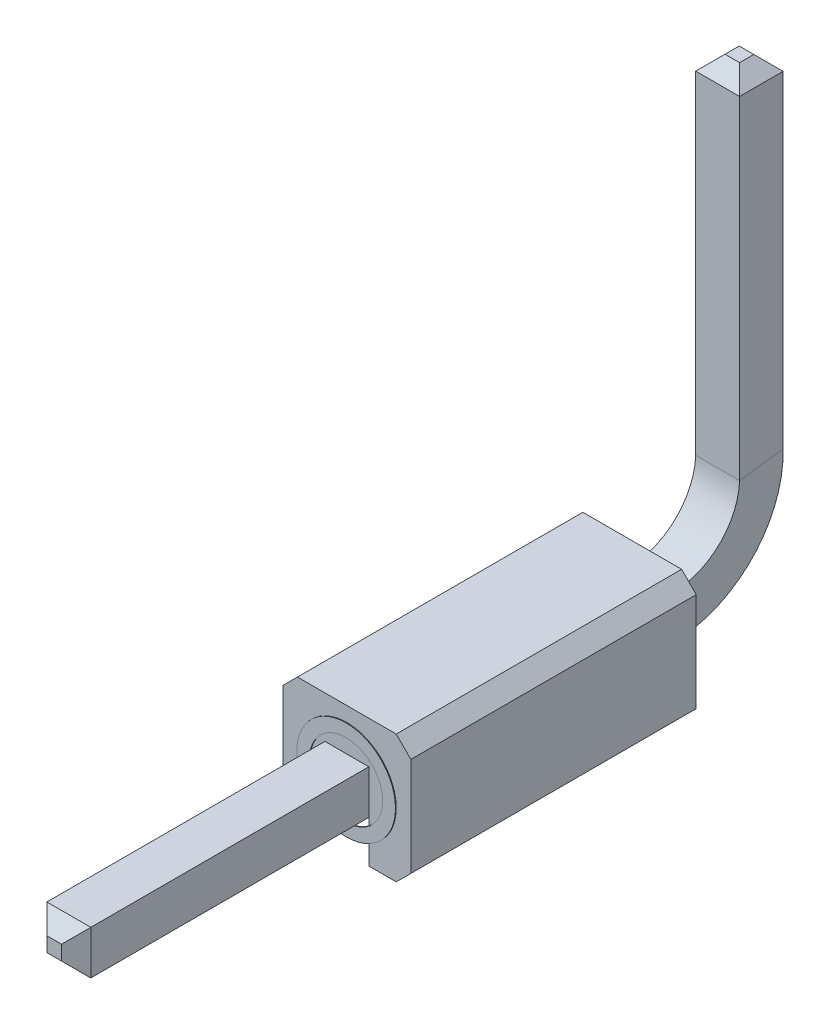
ISO-10303-21;
HEADER;
FILE_DESCRIPTION(('STEP AP214'),'2;1');
FILE_NAME('part.step','',(''),(''),'','','');
FILE_SCHEMA(('AUTOMOTIVE_DESIGN { 1 0 10303 214 1 1 1 1 }'));
ENDSEC;
DATA;
#1=APPLICATION_CONTEXT('core data for automotive mechanical design processes');
#2=APPLICATION_PROTOCOL_DEFINITION('international standard','automotive_design',2000,#1);
#3=PRODUCT_CONTEXT('',#1,'mechanical');
#4=PRODUCT('Part','Part','',(#3));
#5=PRODUCT_RELATED_PRODUCT_CATEGORY('part','',(#4));
#6=PRODUCT_DEFINITION_FORMATION('','',#4);
#7=PRODUCT_DEFINITION_CONTEXT('part definition',#1,'design');
#8=PRODUCT_DEFINITION('design','',#6,#7);
#9=PRODUCT_DEFINITION_SHAPE('','',#8);
#10=(LENGTH_UNIT() NAMED_UNIT(*) SI_UNIT(.MILLI.,.METRE.));
#11=(NAMED_UNIT(*) PLANE_ANGLE_UNIT() SI_UNIT($,.RADIAN.));
#12=(NAMED_UNIT(*) SI_UNIT($,.STERADIAN.) SOLID_ANGLE_UNIT());
#13=UNCERTAINTY_MEASURE_WITH_UNIT(LENGTH_MEASURE(1.E-05),#10,'distance_accuracy_value','');
#14=(GEOMETRIC_REPRESENTATION_CONTEXT(3) GLOBAL_UNCERTAINTY_ASSIGNED_CONTEXT((#13)) GLOBAL_UNIT_ASSIGNED_CONTEXT((#10,
#11,#12)) REPRESENTATION_CONTEXT('',''));
#15=CARTESIAN_POINT('',(0.,0.,0.));
#16=DIRECTION('',(0.,0.,1.));
#17=DIRECTION('',(1.,0.,0.));
#18=AXIS2_PLACEMENT_3D('',#15,#16,#17);
#19=CARTESIAN_POINT('',(-0.3,1.15200115929378,-2.26783114914556));
#20=DIRECTION('',(0.,0.,1.));
#21=DIRECTION('',(1.,0.,0.));
#22=AXIS2_PLACEMENT_3D('',#19,#20,#21);
#23=PLANE('',#22);
#24=DIRECTION('',(0.,1.,0.));
#25=VECTOR('',#24,1.);
#26=CARTESIAN_POINT('',(0.3,1.15200115929378,-2.26783114914556));
#27=LINE('',#26,#25);
#28=CARTESIAN_POINT('',(0.3,1.15200115929378,-2.26783114914556));
#29=VERTEX_POINT('',#28);
#30=CARTESIAN_POINT('',(0.3,5.7,-2.26783114914556));
#31=VERTEX_POINT('',#30);
#32=EDGE_CURVE('E604',#29,#31,#27,.T.);
#33=ORIENTED_EDGE('',*,*,#32,.T.);
#34=DIRECTION('',(-1.,0.,0.));
#35=VECTOR('',#34,1.);
#36=CARTESIAN_POINT('',(-0.3,5.7,-2.26783114914556));
#37=LINE('',#36,#35);
#38=CARTESIAN_POINT('',(-0.3,5.7,-2.26783114914556));
#39=VERTEX_POINT('',#38);
#40=EDGE_CURVE('E386',#31,#39,#37,.T.);
#41=ORIENTED_EDGE('',*,*,#40,.T.);
#42=DIRECTION('',(0.,1.,0.));
#43=VECTOR('',#42,1.);
#44=CARTESIAN_POINT('',(-0.3,1.15200115929378,-2.26783114914556));
#45=LINE('',#44,#43);
#46=CARTESIAN_POINT('',(-0.3,1.15200115929378,-2.26783114914556));
#47=VERTEX_POINT('',#46);
#48=EDGE_CURVE('E593',#47,#39,#45,.T.);
#49=ORIENTED_EDGE('',*,*,#48,.F.);
#50=DIRECTION('',(1.,0.,0.));
#51=VECTOR('',#50,1.);
#52=CARTESIAN_POINT('',(-0.3,1.15200115929378,-2.26783114914556));
#53=LINE('',#52,#51);
#54=EDGE_CURVE('E236',#47,#29,#53,.T.);
#55=ORIENTED_EDGE('',*,*,#54,.T.);
#56=EDGE_LOOP('',(#33,#41,#49,#55));
#57=FACE_BOUND('',#56,.T.);
#58=ADVANCED_FACE('F34',(#57),#23,.T.);
#59=CARTESIAN_POINT('',(0.3,1.15200115929378,-2.26783114914556));
#60=DIRECTION('',(1.,0.,0.));
#61=DIRECTION('',(0.,0.,-1.));
#62=AXIS2_PLACEMENT_3D('',#59,#60,#61);
#63=PLANE('',#62);
#64=DIRECTION('',(0.,1.,0.));
#65=VECTOR('',#64,1.);
#66=CARTESIAN_POINT('',(0.3,1.2326939716059,-2.86238028087578));
#67=LINE('',#66,#65);
#68=CARTESIAN_POINT('',(0.3,1.2326939716059,-2.86238028087578));
#69=VERTEX_POINT('',#68);
#70=CARTESIAN_POINT('',(0.3,5.7,-2.86238028087578));
#71=VERTEX_POINT('',#70);
#72=EDGE_CURVE('E588',#69,#71,#67,.T.);
#73=ORIENTED_EDGE('',*,*,#72,.T.);
#74=DIRECTION('',(0.,0.,1.));
#75=VECTOR('',#74,1.);
#76=CARTESIAN_POINT('',(0.3,5.7,-2.26783114914556));
#77=LINE('',#76,#75);
#78=EDGE_CURVE('E402',#71,#31,#77,.T.);
#79=ORIENTED_EDGE('',*,*,#78,.T.);
#80=ORIENTED_EDGE('',*,*,#32,.F.);
#81=DIRECTION('',(0.,0.134488020520202,-0.99091521955037));
#82=VECTOR('',#81,1.);
#83=CARTESIAN_POINT('',(0.3,1.15200115929378,-2.26783114914556));
#84=LINE('',#83,#82);
#85=EDGE_CURVE('E607',#29,#69,#84,.T.);
#86=ORIENTED_EDGE('',*,*,#85,.T.);
#87=EDGE_LOOP('',(#73,#79,#80,#86));
#88=FACE_BOUND('',#87,.T.);
#89=ADVANCED_FACE('F477',(#88),#63,.T.);
#90=CARTESIAN_POINT('',(0.3,1.2326939716059,-2.86238028087578));
#91=DIRECTION('',(0.,0.,-1.));
#92=DIRECTION('',(-1.,0.,0.));
#93=AXIS2_PLACEMENT_3D('',#90,#91,#92);
#94=PLANE('',#93);
#95=DIRECTION('',(0.,1.,0.));
#96=VECTOR('',#95,1.);
#97=CARTESIAN_POINT('',(-0.3,1.2326939716059,-2.86238028087578));
#98=LINE('',#97,#96);
#99=CARTESIAN_POINT('',(-0.3,1.2326939716059,-2.86238028087578));
#100=VERTEX_POINT('',#99);
#101=CARTESIAN_POINT('',(-0.3,5.7,-2.86238028087578));
#102=VERTEX_POINT('',#101);
#103=EDGE_CURVE('E583',#100,#102,#98,.T.);
#104=ORIENTED_EDGE('',*,*,#103,.T.);
#105=DIRECTION('',(1.,0.,0.));
#106=VECTOR('',#105,1.);
#107=CARTESIAN_POINT('',(0.3,5.7,-2.86238028087578));
#108=LINE('',#107,#106);
#109=EDGE_CURVE('E400',#102,#71,#108,.T.);
#110=ORIENTED_EDGE('',*,*,#109,.T.);
#111=ORIENTED_EDGE('',*,*,#72,.F.);
#112=DIRECTION('',(-1.,0.,0.));
#113=VECTOR('',#112,1.);
#114=CARTESIAN_POINT('',(0.3,1.2326939716059,-2.86238028087578));
#115=LINE('',#114,#113);
#116=EDGE_CURVE('E598',#69,#100,#115,.T.);
#117=ORIENTED_EDGE('',*,*,#116,.T.);
#118=EDGE_LOOP('',(#104,#110,#111,#117));
#119=FACE_BOUND('',#118,.T.);
#120=ADVANCED_FACE('F483',(#119),#94,.T.);
#121=CARTESIAN_POINT('',(-0.3,1.2326939716059,-2.86238028087578));
#122=DIRECTION('',(-1.,0.,0.));
#123=DIRECTION('',(0.,0.,1.));
#124=AXIS2_PLACEMENT_3D('',#121,#122,#123);
#125=PLANE('',#124);
#126=ORIENTED_EDGE('',*,*,#48,.T.);
#127=DIRECTION('',(0.,0.,-1.));
#128=VECTOR('',#127,1.);
#129=CARTESIAN_POINT('',(-0.3,5.7,-2.86238028087578));
#130=LINE('',#129,#128);
#131=EDGE_CURVE('E398',#39,#102,#130,.T.);
#132=ORIENTED_EDGE('',*,*,#131,.T.);
#133=ORIENTED_EDGE('',*,*,#103,.F.);
#134=DIRECTION('',(0.,-0.134488020520202,0.99091521955037));
#135=VECTOR('',#134,1.);
#136=CARTESIAN_POINT('',(-0.3,1.2326939716059,-2.86238028087578));
#137=LINE('',#136,#135);
#138=EDGE_CURVE('E591',#100,#47,#137,.T.);
#139=ORIENTED_EDGE('',*,*,#138,.T.);
#140=EDGE_LOOP('',(#126,#132,#133,#139));
#141=FACE_BOUND('',#140,.T.);
#142=ADVANCED_FACE('F498',(#141),#125,.T.);
#143=CARTESIAN_POINT('',(0.,0.,2.8));
#144=DIRECTION('',(0.,0.,-1.));
#145=DIRECTION('',(-1.,0.,0.));
#146=AXIS2_PLACEMENT_3D('',#143,#144,#145);
#147=PLANE('',#146);
#148=DIRECTION('',(0.,1.,0.));
#149=VECTOR('',#148,1.);
#150=CARTESIAN_POINT('',(0.3,0.3,2.8));
#151=LINE('',#150,#149);
#152=CARTESIAN_POINT('',(0.3,-0.4,2.8));
#153=VERTEX_POINT('',#152);
#154=CARTESIAN_POINT('',(0.3,-0.3,2.8));
#155=VERTEX_POINT('',#154);
#156=EDGE_CURVE('E300',#153,#155,#151,.T.);
#157=ORIENTED_EDGE('',*,*,#156,.F.);
#158=CARTESIAN_POINT('',(0.,0.,2.8));
#159=DIRECTION('',(0.,0.,-1.));
#160=DIRECTION('',(-1.,0.,0.));
#161=AXIS2_PLACEMENT_3D('',#158,#159,#160);
#162=CIRCLE('',#161,0.5);
#163=CARTESIAN_POINT('',(-0.3,-0.4,2.8));
#164=VERTEX_POINT('',#163);
#165=EDGE_CURVE('E367',#153,#164,#162,.F.);
#166=ORIENTED_EDGE('',*,*,#165,.T.);
#167=DIRECTION('',(0.,-1.,0.));
#168=VECTOR('',#167,1.);
#169=CARTESIAN_POINT('',(-0.3,0.3,2.8));
#170=LINE('',#169,#168);
#171=CARTESIAN_POINT('',(-0.3,-0.3,2.8));
#172=VERTEX_POINT('',#171);
#173=EDGE_CURVE('E306',#172,#164,#170,.T.);
#174=ORIENTED_EDGE('',*,*,#173,.F.);
#175=CARTESIAN_POINT('',(-0.3,0.3,2.8));
#176=VERTEX_POINT('',#175);
#177=EDGE_CURVE('E303',#176,#172,#170,.T.);
#178=ORIENTED_EDGE('',*,*,#177,.F.);
#179=DIRECTION('',(-1.,0.,0.));
#180=VECTOR('',#179,1.);
#181=CARTESIAN_POINT('',(-0.3,0.3,2.8));
#182=LINE('',#181,#180);
#183=CARTESIAN_POINT('',(0.3,0.3,2.8));
#184=VERTEX_POINT('',#183);
#185=EDGE_CURVE('E298',#184,#176,#182,.T.);
#186=ORIENTED_EDGE('',*,*,#185,.F.);
#187=EDGE_CURVE('E292',#155,#184,#151,.T.);
#188=ORIENTED_EDGE('',*,*,#187,.F.);
#189=EDGE_LOOP('',(#157,#166,#174,#178,#186,#188));
#190=FACE_BOUND('',#189,.T.);
#191=ADVANCED_FACE('F502',(#190),#147,.F.);
#192=CARTESIAN_POINT('',(0.675,0.875,-1.1));
#193=DIRECTION('',(0.,1.,0.));
#194=DIRECTION('',(-1.,0.,0.));
#195=AXIS2_PLACEMENT_3D('',#192,#193,#194);
#196=PLANE('',#195);
#197=DIRECTION('',(0.,0.,1.));
#198=VECTOR('',#197,1.);
#199=CARTESIAN_POINT('',(-0.675,0.875,-1.1));
#200=LINE('',#199,#198);
#201=CARTESIAN_POINT('',(-0.675,0.875,-1.1));
#202=VERTEX_POINT('',#201);
#203=CARTESIAN_POINT('',(-0.675,0.875,2.8));
#204=VERTEX_POINT('',#203);
#205=EDGE_CURVE('E364',#202,#204,#200,.T.);
#206=ORIENTED_EDGE('',*,*,#205,.T.);
#207=DIRECTION('',(-1.,0.,0.));
#208=VECTOR('',#207,1.);
#209=CARTESIAN_POINT('',(0.675,0.875,2.8));
#210=LINE('',#209,#208);
#211=CARTESIAN_POINT('',(0.675,0.875,2.8));
#212=VERTEX_POINT('',#211);
#213=EDGE_CURVE('E305',#212,#204,#210,.T.);
#214=ORIENTED_EDGE('',*,*,#213,.F.);
#215=DIRECTION('',(0.,0.,1.));
#216=VECTOR('',#215,1.);
#217=CARTESIAN_POINT('',(0.675,0.875,-1.1));
#218=LINE('',#217,#216);
#219=CARTESIAN_POINT('',(0.675,0.875,-1.1));
#220=VERTEX_POINT('',#219);
#221=EDGE_CURVE('E365',#220,#212,#218,.T.);
#222=ORIENTED_EDGE('',*,*,#221,.F.);
#223=DIRECTION('',(-1.,0.,0.));
#224=VECTOR('',#223,1.);
#225=CARTESIAN_POINT('',(0.675,0.875,-1.1));
#226=LINE('',#225,#224);
#227=EDGE_CURVE('E340',#220,#202,#226,.T.);
#228=ORIENTED_EDGE('',*,*,#227,.T.);
#229=EDGE_LOOP('',(#206,#214,#222,#228));
#230=FACE_BOUND('',#229,.T.);
#231=ADVANCED_FACE('F549',(#230),#196,.T.);
#232=CARTESIAN_POINT('',(0.875,0.675,-1.1));
#233=DIRECTION('',(0.707106781186548,0.707106781186548,0.));
#234=DIRECTION('',(-0.707106781186548,0.707106781186548,0.));
#235=AXIS2_PLACEMENT_3D('',#232,#233,#234);
#236=PLANE('',#235);
#237=ORIENTED_EDGE('',*,*,#221,.T.);
#238=DIRECTION('',(-0.707106781186547,0.707106781186547,0.));
#239=VECTOR('',#238,1.);
#240=CARTESIAN_POINT('',(0.875,0.675,2.8));
#241=LINE('',#240,#239);
#242=CARTESIAN_POINT('',(0.875,0.675,2.8));
#243=VERTEX_POINT('',#242);
#244=EDGE_CURVE('E328',#243,#212,#241,.T.);
#245=ORIENTED_EDGE('',*,*,#244,.F.);
#246=DIRECTION('',(0.,0.,1.));
#247=VECTOR('',#246,1.);
#248=CARTESIAN_POINT('',(0.875,0.675,-1.1));
#249=LINE('',#248,#247);
#250=CARTESIAN_POINT('',(0.875,0.675,-1.1));
#251=VERTEX_POINT('',#250);
#252=EDGE_CURVE('E368',#251,#243,#249,.T.);
#253=ORIENTED_EDGE('',*,*,#252,.F.);
#254=DIRECTION('',(-0.707106781186547,0.707106781186547,0.));
#255=VECTOR('',#254,1.);
#256=CARTESIAN_POINT('',(0.875,0.675,-1.1));
#257=LINE('',#256,#255);
#258=EDGE_CURVE('E361',#251,#220,#257,.T.);
#259=ORIENTED_EDGE('',*,*,#258,.T.);
#260=EDGE_LOOP('',(#237,#245,#253,#259));
#261=FACE_BOUND('',#260,.T.);
#262=ADVANCED_FACE('F546',(#261),#236,.T.);
#263=CARTESIAN_POINT('',(0.875,-0.675,-1.1));
#264=DIRECTION('',(1.,0.,0.));
#265=DIRECTION('',(0.,0.,-1.));
#266=AXIS2_PLACEMENT_3D('',#263,#264,#265);
#267=PLANE('',#266);
#268=ORIENTED_EDGE('',*,*,#252,.T.);
#269=DIRECTION('',(0.,1.,0.));
#270=VECTOR('',#269,1.);
#271=CARTESIAN_POINT('',(0.875,-0.675,2.8));
#272=LINE('',#271,#270);
#273=CARTESIAN_POINT('',(0.875,-0.675,2.8));
#274=VERTEX_POINT('',#273);
#275=EDGE_CURVE('E325',#274,#243,#272,.T.);
#276=ORIENTED_EDGE('',*,*,#275,.F.);
#277=DIRECTION('',(0.,0.,1.));
#278=VECTOR('',#277,1.);
#279=CARTESIAN_POINT('',(0.875,-0.675,-1.1));
#280=LINE('',#279,#278);
#281=CARTESIAN_POINT('',(0.875,-0.675,-1.1));
#282=VERTEX_POINT('',#281);
#283=EDGE_CURVE('E370',#282,#274,#280,.T.);
#284=ORIENTED_EDGE('',*,*,#283,.F.);
#285=DIRECTION('',(0.,1.,0.));
#286=VECTOR('',#285,1.);
#287=CARTESIAN_POINT('',(0.875,-0.675,-1.1));
#288=LINE('',#287,#286);
#289=EDGE_CURVE('E358',#282,#251,#288,.T.);
#290=ORIENTED_EDGE('',*,*,#289,.T.);
#291=EDGE_LOOP('',(#268,#276,#284,#290));
#292=FACE_BOUND('',#291,.T.);
#293=ADVANCED_FACE('F542',(#292),#267,.T.);
#294=CARTESIAN_POINT('',(0.875,-0.675,-1.1));
#295=DIRECTION('',(0.707106781186548,-0.707106781186548,0.));
#296=DIRECTION('',(0.707106781186548,0.707106781186548,0.));
#297=AXIS2_PLACEMENT_3D('',#294,#295,#296);
#298=PLANE('',#297);
#299=ORIENTED_EDGE('',*,*,#283,.T.);
#300=DIRECTION('',(0.707106781186547,0.707106781186547,0.));
#301=VECTOR('',#300,1.);
#302=CARTESIAN_POINT('',(0.875,-0.675,2.8));
#303=LINE('',#302,#301);
#304=CARTESIAN_POINT('',(0.675,-0.875,2.8));
#305=VERTEX_POINT('',#304);
#306=EDGE_CURVE('E322',#305,#274,#303,.T.);
#307=ORIENTED_EDGE('',*,*,#306,.F.);
#308=DIRECTION('',(0.,0.,1.));
#309=VECTOR('',#308,1.);
#310=CARTESIAN_POINT('',(0.675,-0.875,-1.1));
#311=LINE('',#310,#309);
#312=CARTESIAN_POINT('',(0.675,-0.875,-1.1));
#313=VERTEX_POINT('',#312);
#314=EDGE_CURVE('E372',#313,#305,#311,.T.);
#315=ORIENTED_EDGE('',*,*,#314,.F.);
#316=DIRECTION('',(0.707106781186547,0.707106781186547,0.));
#317=VECTOR('',#316,1.);
#318=CARTESIAN_POINT('',(0.875,-0.675,-1.1));
#319=LINE('',#318,#317);
#320=EDGE_CURVE('E355',#313,#282,#319,.T.);
#321=ORIENTED_EDGE('',*,*,#320,.T.);
#322=EDGE_LOOP('',(#299,#307,#315,#321));
#323=FACE_BOUND('',#322,.T.);
#324=ADVANCED_FACE('F795',(#323),#298,.T.);
#325=CARTESIAN_POINT('',(0.675,-0.875,-1.1));
#326=DIRECTION('',(0.,-1.,0.));
#327=DIRECTION('',(1.,0.,0.));
#328=AXIS2_PLACEMENT_3D('',#325,#326,#327);
#329=PLANE('',#328);
#330=DIRECTION('',(0.,0.,1.));
#331=VECTOR('',#330,1.);
#332=CARTESIAN_POINT('',(-0.3,-0.875,1.8));
#333=LINE('',#332,#331);
#334=CARTESIAN_POINT('',(-0.3,-0.875,1.8));
#335=VERTEX_POINT('',#334);
#336=CARTESIAN_POINT('',(-0.3,-0.875,2.8));
#337=VERTEX_POINT('',#336);
#338=EDGE_CURVE('E288',#335,#337,#333,.T.);
#339=ORIENTED_EDGE('',*,*,#338,.T.);
#340=DIRECTION('',(1.,0.,0.));
#341=VECTOR('',#340,1.);
#342=CARTESIAN_POINT('',(0.675,-0.875,2.8));
#343=LINE('',#342,#341);
#344=CARTESIAN_POINT('',(-0.675,-0.875,2.8));
#345=VERTEX_POINT('',#344);
#346=EDGE_CURVE('E319',#345,#337,#343,.T.);
#347=ORIENTED_EDGE('',*,*,#346,.F.);
#348=DIRECTION('',(0.,0.,1.));
#349=VECTOR('',#348,1.);
#350=CARTESIAN_POINT('',(-0.675,-0.875,-1.1));
#351=LINE('',#350,#349);
#352=CARTESIAN_POINT('',(-0.675,-0.875,-1.1));
#353=VERTEX_POINT('',#352);
#354=EDGE_CURVE('E375',#353,#345,#351,.T.);
#355=ORIENTED_EDGE('',*,*,#354,.F.);
#356=DIRECTION('',(1.,0.,0.));
#357=VECTOR('',#356,1.);
#358=CARTESIAN_POINT('',(0.675,-0.875,-1.1));
#359=LINE('',#358,#357);
#360=EDGE_CURVE('E352',#353,#313,#359,.T.);
#361=ORIENTED_EDGE('',*,*,#360,.T.);
#362=ORIENTED_EDGE('',*,*,#314,.T.);
#363=CARTESIAN_POINT('',(0.3,-0.875,2.8));
#364=VERTEX_POINT('',#363);
#365=EDGE_CURVE('E318',#364,#305,#343,.T.);
#366=ORIENTED_EDGE('',*,*,#365,.F.);
#367=DIRECTION('',(0.,0.,1.));
#368=VECTOR('',#367,1.);
#369=CARTESIAN_POINT('',(0.3,-0.875,1.8));
#370=LINE('',#369,#368);
#371=CARTESIAN_POINT('',(0.3,-0.875,1.8));
#372=VERTEX_POINT('',#371);
#373=EDGE_CURVE('E289',#372,#364,#370,.T.);
#374=ORIENTED_EDGE('',*,*,#373,.F.);
#375=DIRECTION('',(1.,0.,0.));
#376=VECTOR('',#375,1.);
#377=CARTESIAN_POINT('',(-0.3,-0.875,1.8));
#378=LINE('',#377,#376);
#379=EDGE_CURVE('E279',#335,#372,#378,.T.);
#380=ORIENTED_EDGE('',*,*,#379,.F.);
#381=EDGE_LOOP('',(#339,#347,#355,#361,#362,#366,#374,#380));
#382=FACE_BOUND('',#381,.T.);
#383=ADVANCED_FACE('F536',(#382),#329,.T.);
#384=CARTESIAN_POINT('',(-0.675,-0.875,-1.1));
#385=DIRECTION('',(-0.707106781186548,-0.707106781186548,0.));
#386=DIRECTION('',(0.707106781186548,-0.707106781186548,0.));
#387=AXIS2_PLACEMENT_3D('',#384,#385,#386);
#388=PLANE('',#387);
#389=ORIENTED_EDGE('',*,*,#354,.T.);
#390=DIRECTION('',(0.707106781186547,-0.707106781186547,0.));
#391=VECTOR('',#390,1.);
#392=CARTESIAN_POINT('',(-0.675,-0.875,2.8));
#393=LINE('',#392,#391);
#394=CARTESIAN_POINT('',(-0.875,-0.675,2.8));
#395=VERTEX_POINT('',#394);
#396=EDGE_CURVE('E315',#395,#345,#393,.T.);
#397=ORIENTED_EDGE('',*,*,#396,.F.);
#398=DIRECTION('',(0.,0.,1.));
#399=VECTOR('',#398,1.);
#400=CARTESIAN_POINT('',(-0.875,-0.675,-1.1));
#401=LINE('',#400,#399);
#402=CARTESIAN_POINT('',(-0.875,-0.675,-1.1));
#403=VERTEX_POINT('',#402);
#404=EDGE_CURVE('E377',#403,#395,#401,.T.);
#405=ORIENTED_EDGE('',*,*,#404,.F.);
#406=DIRECTION('',(0.707106781186547,-0.707106781186547,0.));
#407=VECTOR('',#406,1.);
#408=CARTESIAN_POINT('',(-0.675,-0.875,-1.1));
#409=LINE('',#408,#407);
#410=EDGE_CURVE('E349',#403,#353,#409,.T.);
#411=ORIENTED_EDGE('',*,*,#410,.T.);
#412=EDGE_LOOP('',(#389,#397,#405,#411));
#413=FACE_BOUND('',#412,.T.);
#414=ADVANCED_FACE('F562',(#413),#388,.T.);
#415=CARTESIAN_POINT('',(-0.875,-0.675,-1.1));
#416=DIRECTION('',(-1.,0.,0.));
#417=DIRECTION('',(0.,0.,1.));
#418=AXIS2_PLACEMENT_3D('',#415,#416,#417);
#419=PLANE('',#418);
#420=ORIENTED_EDGE('',*,*,#404,.T.);
#421=DIRECTION('',(0.,-1.,0.));
#422=VECTOR('',#421,1.);
#423=CARTESIAN_POINT('',(-0.875,-0.675,2.8));
#424=LINE('',#423,#422);
#425=CARTESIAN_POINT('',(-0.875,0.675,2.8));
#426=VERTEX_POINT('',#425);
#427=EDGE_CURVE('E312',#426,#395,#424,.T.);
#428=ORIENTED_EDGE('',*,*,#427,.F.);
#429=DIRECTION('',(0.,0.,1.));
#430=VECTOR('',#429,1.);
#431=CARTESIAN_POINT('',(-0.875,0.675,-1.1));
#432=LINE('',#431,#430);
#433=CARTESIAN_POINT('',(-0.875,0.675,-1.1));
#434=VERTEX_POINT('',#433);
#435=EDGE_CURVE('E379',#434,#426,#432,.T.);
#436=ORIENTED_EDGE('',*,*,#435,.F.);
#437=DIRECTION('',(0.,-1.,0.));
#438=VECTOR('',#437,1.);
#439=CARTESIAN_POINT('',(-0.875,-0.675,-1.1));
#440=LINE('',#439,#438);
#441=EDGE_CURVE('E346',#434,#403,#440,.T.);
#442=ORIENTED_EDGE('',*,*,#441,.T.);
#443=EDGE_LOOP('',(#420,#428,#436,#442));
#444=FACE_BOUND('',#443,.T.);
#445=ADVANCED_FACE('F558',(#444),#419,.T.);
#446=CARTESIAN_POINT('',(-0.675,0.875,-1.1));
#447=DIRECTION('',(-0.707106781186548,0.707106781186548,0.));
#448=DIRECTION('',(-0.707106781186548,-0.707106781186548,0.));
#449=AXIS2_PLACEMENT_3D('',#446,#447,#448);
#450=PLANE('',#449);
#451=ORIENTED_EDGE('',*,*,#435,.T.);
#452=DIRECTION('',(-0.707106781186547,-0.707106781186547,0.));
#453=VECTOR('',#452,1.);
#454=CARTESIAN_POINT('',(-0.675,0.875,2.8));
#455=LINE('',#454,#453);
#456=EDGE_CURVE('E309',#204,#426,#455,.T.);
#457=ORIENTED_EDGE('',*,*,#456,.F.);
#458=ORIENTED_EDGE('',*,*,#205,.F.);
#459=DIRECTION('',(-0.707106781186547,-0.707106781186547,0.));
#460=VECTOR('',#459,1.);
#461=CARTESIAN_POINT('',(-0.675,0.875,-1.1));
#462=LINE('',#461,#460);
#463=EDGE_CURVE('E343',#202,#434,#462,.T.);
#464=ORIENTED_EDGE('',*,*,#463,.T.);
#465=EDGE_LOOP('',(#451,#457,#458,#464));
#466=FACE_BOUND('',#465,.T.);
#467=ADVANCED_FACE('F554',(#466),#450,.T.);
#468=CARTESIAN_POINT('',(0.,0.,-1.1));
#469=DIRECTION('',(0.,0.,-1.));
#470=DIRECTION('',(-1.,0.,0.));
#471=AXIS2_PLACEMENT_3D('',#468,#469,#470);
#472=PLANE('',#471);
#473=DIRECTION('',(0.,1.,0.));
#474=VECTOR('',#473,1.);
#475=CARTESIAN_POINT('',(0.3,0.3,-1.1));
#476=LINE('',#475,#474);
#477=CARTESIAN_POINT('',(0.3,-0.3,-1.1));
#478=VERTEX_POINT('',#477);
#479=CARTESIAN_POINT('',(0.3,0.3,-1.1));
#480=VERTEX_POINT('',#479);
#481=EDGE_CURVE('E331',#478,#480,#476,.T.);
#482=ORIENTED_EDGE('',*,*,#481,.T.);
#483=DIRECTION('',(-1.,0.,0.));
#484=VECTOR('',#483,1.);
#485=CARTESIAN_POINT('',(-0.3,0.3,-1.1));
#486=LINE('',#485,#484);
#487=CARTESIAN_POINT('',(-0.3,0.3,-1.1));
#488=VERTEX_POINT('',#487);
#489=EDGE_CURVE('E334',#480,#488,#486,.T.);
#490=ORIENTED_EDGE('',*,*,#489,.T.);
#491=DIRECTION('',(0.,-1.,0.));
#492=VECTOR('',#491,1.);
#493=CARTESIAN_POINT('',(-0.3,0.3,-1.1));
#494=LINE('',#493,#492);
#495=CARTESIAN_POINT('',(-0.3,-0.3,-1.1));
#496=VERTEX_POINT('',#495);
#497=EDGE_CURVE('E246',#488,#496,#494,.T.);
#498=ORIENTED_EDGE('',*,*,#497,.T.);
#499=DIRECTION('',(1.,0.,0.));
#500=VECTOR('',#499,1.);
#501=CARTESIAN_POINT('',(-0.3,-0.3,-1.1));
#502=LINE('',#501,#500);
#503=EDGE_CURVE('E337',#496,#478,#502,.T.);
#504=ORIENTED_EDGE('',*,*,#503,.T.);
#505=EDGE_LOOP('',(#482,#490,#498,#504));
#506=FACE_BOUND('',#505,.T.);
#507=ORIENTED_EDGE('',*,*,#227,.F.);
#508=ORIENTED_EDGE('',*,*,#258,.F.);
#509=ORIENTED_EDGE('',*,*,#289,.F.);
#510=ORIENTED_EDGE('',*,*,#320,.F.);
#511=ORIENTED_EDGE('',*,*,#360,.F.);
#512=ORIENTED_EDGE('',*,*,#410,.F.);
#513=ORIENTED_EDGE('',*,*,#441,.F.);
#514=ORIENTED_EDGE('',*,*,#463,.F.);
#515=EDGE_LOOP('',(#507,#508,#509,#510,#511,#512,#513,#514));
#516=FACE_BOUND('',#515,.T.);
#517=ADVANCED_FACE('F565',(#506,#516),#472,.T.);
#518=CARTESIAN_POINT('',(0.3,0.3,-1.1));
#519=DIRECTION('',(1.,0.,0.));
#520=DIRECTION('',(0.,1.,0.));
#521=AXIS2_PLACEMENT_3D('',#518,#519,#520);
#522=PLANE('',#521);
#523=CARTESIAN_POINT('',(0.3,-0.604273243288872,2.8));
#524=VERTEX_POINT('',#523);
#525=EDGE_CURVE('E295',#364,#524,#151,.T.);
#526=ORIENTED_EDGE('',*,*,#525,.T.);
#527=EDGE_CURVE('E299',#524,#153,#151,.T.);
#528=ORIENTED_EDGE('',*,*,#527,.T.);
#529=ORIENTED_EDGE('',*,*,#156,.T.);
#530=DIRECTION('',(0.,0.,1.));
#531=VECTOR('',#530,1.);
#532=CARTESIAN_POINT('',(0.3,-0.3,-1.2));
#533=LINE('',#532,#531);
#534=CARTESIAN_POINT('',(0.3,-0.3,1.8));
#535=VERTEX_POINT('',#534);
#536=EDGE_CURVE('E271',#535,#155,#533,.T.);
#537=ORIENTED_EDGE('',*,*,#536,.F.);
#538=DIRECTION('',(0.,1.,0.));
#539=VECTOR('',#538,1.);
#540=CARTESIAN_POINT('',(0.3,-0.3,1.8));
#541=LINE('',#540,#539);
#542=EDGE_CURVE('E282',#372,#535,#541,.T.);
#543=ORIENTED_EDGE('',*,*,#542,.F.);
#544=ORIENTED_EDGE('',*,*,#373,.T.);
#545=EDGE_LOOP('',(#526,#528,#529,#537,#543,#544));
#546=FACE_BOUND('',#545,.T.);
#547=ADVANCED_FACE('F531',(#546),#522,.F.);
#548=CARTESIAN_POINT('',(-0.3,0.3,-1.1));
#549=DIRECTION('',(-1.,0.,0.));
#550=DIRECTION('',(0.,-1.,0.));
#551=AXIS2_PLACEMENT_3D('',#548,#549,#550);
#552=PLANE('',#551);
#553=DIRECTION('',(0.,-1.,0.));
#554=VECTOR('',#553,1.);
#555=CARTESIAN_POINT('',(-0.3,-0.3,1.8));
#556=LINE('',#555,#554);
#557=CARTESIAN_POINT('',(-0.3,-0.3,1.8));
#558=VERTEX_POINT('',#557);
#559=EDGE_CURVE('E270',#558,#335,#556,.T.);
#560=ORIENTED_EDGE('',*,*,#559,.F.);
#561=DIRECTION('',(0.,0.,1.));
#562=VECTOR('',#561,1.);
#563=CARTESIAN_POINT('',(-0.3,-0.3,-1.2));
#564=LINE('',#563,#562);
#565=EDGE_CURVE('E274',#558,#172,#564,.T.);
#566=ORIENTED_EDGE('',*,*,#565,.T.);
#567=ORIENTED_EDGE('',*,*,#173,.T.);
#568=CARTESIAN_POINT('',(-0.3,-0.604273243288872,2.8));
#569=VERTEX_POINT('',#568);
#570=EDGE_CURVE('E579',#164,#569,#170,.T.);
#571=ORIENTED_EDGE('',*,*,#570,.T.);
#572=EDGE_CURVE('E302',#569,#337,#170,.T.);
#573=ORIENTED_EDGE('',*,*,#572,.T.);
#574=ORIENTED_EDGE('',*,*,#338,.F.);
#575=EDGE_LOOP('',(#560,#566,#567,#571,#573,#574));
#576=FACE_BOUND('',#575,.T.);
#577=ADVANCED_FACE('F570',(#576),#552,.F.);
#578=CARTESIAN_POINT('',(0.,0.,2.8));
#579=DIRECTION('',(0.,0.,-1.));
#580=DIRECTION('',(-1.,0.,0.));
#581=AXIS2_PLACEMENT_3D('',#578,#579,#580);
#582=CIRCLE('',#581,0.674645204944682);
#583=EDGE_CURVE('E384',#524,#569,#582,.F.);
#584=ORIENTED_EDGE('',*,*,#583,.F.);
#585=ORIENTED_EDGE('',*,*,#525,.F.);
#586=ORIENTED_EDGE('',*,*,#365,.T.);
#587=ORIENTED_EDGE('',*,*,#306,.T.);
#588=ORIENTED_EDGE('',*,*,#275,.T.);
#589=ORIENTED_EDGE('',*,*,#244,.T.);
#590=ORIENTED_EDGE('',*,*,#213,.T.);
#591=ORIENTED_EDGE('',*,*,#456,.T.);
#592=ORIENTED_EDGE('',*,*,#427,.T.);
#593=ORIENTED_EDGE('',*,*,#396,.T.);
#594=ORIENTED_EDGE('',*,*,#346,.T.);
#595=ORIENTED_EDGE('',*,*,#572,.F.);
#596=EDGE_LOOP('',(#584,#585,#586,#587,#588,#589,#590,#591,#592,#593,#594,#595));
#597=FACE_BOUND('',#596,.T.);
#598=ADVANCED_FACE('F471',(#597),#147,.F.);
#599=CARTESIAN_POINT('',(0.,0.,1.8));
#600=DIRECTION('',(0.,0.,1.));
#601=DIRECTION('',(1.,0.,0.));
#602=AXIS2_PLACEMENT_3D('',#599,#600,#601);
#603=PLANE('',#602);
#604=ORIENTED_EDGE('',*,*,#559,.T.);
#605=ORIENTED_EDGE('',*,*,#379,.T.);
#606=ORIENTED_EDGE('',*,*,#542,.T.);
#607=DIRECTION('',(-1.,0.,0.));
#608=VECTOR('',#607,1.);
#609=CARTESIAN_POINT('',(-0.3,-0.3,1.8));
#610=LINE('',#609,#608);
#611=EDGE_CURVE('E285',#535,#558,#610,.T.);
#612=ORIENTED_EDGE('',*,*,#611,.T.);
#613=EDGE_LOOP('',(#604,#605,#606,#612));
#614=FACE_BOUND('',#613,.T.);
#615=ADVANCED_FACE('F464',(#614),#603,.T.);
#616=CARTESIAN_POINT('',(0.,0.,6.8));
#617=DIRECTION('',(0.,0.,1.));
#618=DIRECTION('',(1.,0.,0.));
#619=AXIS2_PLACEMENT_3D('',#616,#617,#618);
#620=PLANE('',#619);
#621=DIRECTION('',(0.,-1.,0.));
#622=VECTOR('',#621,1.);
#623=CARTESIAN_POINT('',(-0.100000000000001,0.,6.8));
#624=LINE('',#623,#622);
#625=CARTESIAN_POINT('',(-0.100000000000001,0.100000000000001,6.8));
#626=VERTEX_POINT('',#625);
#627=CARTESIAN_POINT('',(-0.100000000000001,-0.100000000000001,6.8));
#628=VERTEX_POINT('',#627);
#629=EDGE_CURVE('E408',#626,#628,#624,.T.);
#630=ORIENTED_EDGE('',*,*,#629,.T.);
#631=DIRECTION('',(1.,0.,0.));
#632=VECTOR('',#631,1.);
#633=CARTESIAN_POINT('',(0.,-0.100000000000001,6.8));
#634=LINE('',#633,#632);
#635=CARTESIAN_POINT('',(0.100000000000001,-0.100000000000001,6.8));
#636=VERTEX_POINT('',#635);
#637=EDGE_CURVE('E410',#628,#636,#634,.T.);
#638=ORIENTED_EDGE('',*,*,#637,.T.);
#639=DIRECTION('',(0.,1.,0.));
#640=VECTOR('',#639,1.);
#641=CARTESIAN_POINT('',(0.100000000000001,0.,6.8));
#642=LINE('',#641,#640);
#643=CARTESIAN_POINT('',(0.100000000000001,0.100000000000001,6.8));
#644=VERTEX_POINT('',#643);
#645=EDGE_CURVE('E404',#636,#644,#642,.T.);
#646=ORIENTED_EDGE('',*,*,#645,.T.);
#647=DIRECTION('',(-1.,0.,0.));
#648=VECTOR('',#647,1.);
#649=CARTESIAN_POINT('',(0.,0.100000000000001,6.8));
#650=LINE('',#649,#648);
#651=EDGE_CURVE('E406',#644,#626,#650,.T.);
#652=ORIENTED_EDGE('',*,*,#651,.T.);
#653=EDGE_LOOP('',(#630,#638,#646,#652));
#654=FACE_BOUND('',#653,.T.);
#655=ADVANCED_FACE('F461',(#654),#620,.T.);
#656=CARTESIAN_POINT('',(0.3,0.3,-1.2));
#657=DIRECTION('',(0.,1.,0.));
#658=DIRECTION('',(0.,0.,1.));
#659=AXIS2_PLACEMENT_3D('',#656,#657,#658);
#660=PLANE('',#659);
#661=DIRECTION('',(0.,0.,1.));
#662=VECTOR('',#661,1.);
#663=CARTESIAN_POINT('',(-0.3,0.3,-1.2));
#664=LINE('',#663,#662);
#665=CARTESIAN_POINT('',(-0.3,0.3,6.6));
#666=VERTEX_POINT('',#665);
#667=EDGE_CURVE('E250',#176,#666,#664,.T.);
#668=ORIENTED_EDGE('',*,*,#667,.T.);
#669=DIRECTION('',(1.,0.,0.));
#670=VECTOR('',#669,1.);
#671=CARTESIAN_POINT('',(0.3,0.3,6.6));
#672=LINE('',#671,#670);
#673=CARTESIAN_POINT('',(0.3,0.3,6.6));
#674=VERTEX_POINT('',#673);
#675=EDGE_CURVE('E43',#666,#674,#672,.T.);
#676=ORIENTED_EDGE('',*,*,#675,.T.);
#677=DIRECTION('',(0.,0.,1.));
#678=VECTOR('',#677,1.);
#679=CARTESIAN_POINT('',(0.3,0.3,-1.2));
#680=LINE('',#679,#678);
#681=EDGE_CURVE('E260',#184,#674,#680,.T.);
#682=ORIENTED_EDGE('',*,*,#681,.F.);
#683=ORIENTED_EDGE('',*,*,#185,.T.);
#684=EDGE_LOOP('',(#668,#676,#682,#683));
#685=FACE_BOUND('',#684,.T.);
#686=ADVANCED_FACE('F463',(#685),#660,.T.);
#687=CARTESIAN_POINT('',(0.3,-0.3,-1.2));
#688=DIRECTION('',(0.,-1.,0.));
#689=DIRECTION('',(0.,0.,-1.));
#690=AXIS2_PLACEMENT_3D('',#687,#688,#689);
#691=PLANE('',#690);
#692=CARTESIAN_POINT('',(0.3,-0.3,6.6));
#693=VERTEX_POINT('',#692);
#694=EDGE_CURVE('E272',#155,#693,#533,.T.);
#695=ORIENTED_EDGE('',*,*,#694,.T.);
#696=DIRECTION('',(-1.,0.,0.));
#697=VECTOR('',#696,1.);
#698=CARTESIAN_POINT('',(0.3,-0.3,6.6));
#699=LINE('',#698,#697);
#700=CARTESIAN_POINT('',(-0.3,-0.3,6.6));
#701=VERTEX_POINT('',#700);
#702=EDGE_CURVE('E413',#693,#701,#699,.T.);
#703=ORIENTED_EDGE('',*,*,#702,.T.);
#704=EDGE_CURVE('E249',#172,#701,#564,.T.);
#705=ORIENTED_EDGE('',*,*,#704,.F.);
#706=ORIENTED_EDGE('',*,*,#565,.F.);
#707=ORIENTED_EDGE('',*,*,#611,.F.);
#708=ORIENTED_EDGE('',*,*,#536,.T.);
#709=EDGE_LOOP('',(#695,#703,#705,#706,#707,#708));
#710=FACE_BOUND('',#709,.T.);
#711=ADVANCED_FACE('F453',(#710),#691,.T.);
#712=CARTESIAN_POINT('',(-0.3,0.3,-1.2));
#713=DIRECTION('',(-1.,0.,0.));
#714=DIRECTION('',(0.,-1.,0.));
#715=AXIS2_PLACEMENT_3D('',#712,#713,#714);
#716=PLANE('',#715);
#717=ORIENTED_EDGE('',*,*,#704,.T.);
#718=DIRECTION('',(0.,1.,0.));
#719=VECTOR('',#718,1.);
#720=CARTESIAN_POINT('',(-0.3,0.3,6.6));
#721=LINE('',#720,#719);
#722=EDGE_CURVE('E58',#701,#666,#721,.T.);
#723=ORIENTED_EDGE('',*,*,#722,.T.);
#724=ORIENTED_EDGE('',*,*,#667,.F.);
#725=ORIENTED_EDGE('',*,*,#177,.T.);
#726=EDGE_LOOP('',(#717,#723,#724,#725));
#727=FACE_BOUND('',#726,.T.);
#728=ADVANCED_FACE('F578',(#727),#716,.T.);
#729=CARTESIAN_POINT('',(0.3,-0.3,-1.2));
#730=DIRECTION('',(1.,0.,0.));
#731=DIRECTION('',(0.,1.,0.));
#732=AXIS2_PLACEMENT_3D('',#729,#730,#731);
#733=PLANE('',#732);
#734=ORIENTED_EDGE('',*,*,#681,.T.);
#735=DIRECTION('',(0.,-1.,0.));
#736=VECTOR('',#735,1.);
#737=CARTESIAN_POINT('',(0.3,-0.3,6.6));
#738=LINE('',#737,#736);
#739=EDGE_CURVE('E11',#674,#693,#738,.T.);
#740=ORIENTED_EDGE('',*,*,#739,.T.);
#741=ORIENTED_EDGE('',*,*,#694,.F.);
#742=ORIENTED_EDGE('',*,*,#187,.T.);
#743=EDGE_LOOP('',(#734,#740,#741,#742));
#744=FACE_BOUND('',#743,.T.);
#745=ADVANCED_FACE('F449',(#744),#733,.T.);
#746=CARTESIAN_POINT('',(0.3,-0.3,-1.2));
#747=VERTEX_POINT('',#746);
#748=EDGE_CURVE('E267',#747,#478,#533,.T.);
#749=ORIENTED_EDGE('',*,*,#748,.T.);
#750=ORIENTED_EDGE('',*,*,#503,.F.);
#751=CARTESIAN_POINT('',(-0.3,-0.3,-1.2));
#752=VERTEX_POINT('',#751);
#753=EDGE_CURVE('E273',#752,#496,#564,.T.);
#754=ORIENTED_EDGE('',*,*,#753,.F.);
#755=DIRECTION('',(1.,0.,0.));
#756=VECTOR('',#755,1.);
#757=CARTESIAN_POINT('',(0.3,-0.3,-1.2));
#758=LINE('',#757,#756);
#759=EDGE_CURVE('E256',#752,#747,#758,.T.);
#760=ORIENTED_EDGE('',*,*,#759,.T.);
#761=EDGE_LOOP('',(#749,#750,#754,#760));
#762=FACE_BOUND('',#761,.T.);
#763=ADVANCED_FACE('F699',(#762),#691,.T.);
#764=CARTESIAN_POINT('',(0.3,0.3,-1.2));
#765=VERTEX_POINT('',#764);
#766=EDGE_CURVE('E255',#765,#480,#680,.T.);
#767=ORIENTED_EDGE('',*,*,#766,.T.);
#768=ORIENTED_EDGE('',*,*,#481,.F.);
#769=ORIENTED_EDGE('',*,*,#748,.F.);
#770=CARTESIAN_POINT('',(0.3,1.19234756544984,-1.36182662319203));
#771=DIRECTION('',(1.,0.,0.));
#772=DIRECTION('',(0.,-0.994171988312433,0.107805647602083));
#773=AXIS2_PLACEMENT_3D('',#770,#771,#772);
#774=CIRCLE('',#773,1.50109597030896);
#775=EDGE_CURVE('E601',#747,#69,#774,.T.);
#776=ORIENTED_EDGE('',*,*,#775,.T.);
#777=ORIENTED_EDGE('',*,*,#85,.F.);
#778=CARTESIAN_POINT('',(0.3,1.19234756544984,-1.36182662319203));
#779=DIRECTION('',(1.,0.,0.));
#780=DIRECTION('',(0.,-0.983951004267585,0.17843884442803));
#781=AXIS2_PLACEMENT_3D('',#778,#779,#780);
#782=CIRCLE('',#781,0.906902438820178);
#783=EDGE_CURVE('E610',#765,#29,#782,.T.);
#784=ORIENTED_EDGE('',*,*,#783,.F.);
#785=EDGE_LOOP('',(#767,#768,#769,#776,#777,#784));
#786=FACE_BOUND('',#785,.T.);
#787=ADVANCED_FACE('F715',(#786),#733,.T.);
#788=ORIENTED_EDGE('',*,*,#753,.T.);
#789=ORIENTED_EDGE('',*,*,#497,.F.);
#790=CARTESIAN_POINT('',(-0.3,0.3,-1.2));
#791=VERTEX_POINT('',#790);
#792=EDGE_CURVE('E242',#791,#488,#664,.T.);
#793=ORIENTED_EDGE('',*,*,#792,.F.);
#794=CARTESIAN_POINT('',(-0.3,1.19234756544984,-1.36182662319203));
#795=DIRECTION('',(1.,0.,0.));
#796=DIRECTION('',(0.,-0.983951004267585,0.17843884442803));
#797=AXIS2_PLACEMENT_3D('',#794,#795,#796);
#798=CIRCLE('',#797,0.906902438820178);
#799=EDGE_CURVE('E228',#791,#47,#798,.T.);
#800=ORIENTED_EDGE('',*,*,#799,.T.);
#801=ORIENTED_EDGE('',*,*,#138,.F.);
#802=CARTESIAN_POINT('',(-0.3,1.19234756544984,-1.36182662319203));
#803=DIRECTION('',(1.,0.,0.));
#804=DIRECTION('',(0.,-0.994171988312433,0.107805647602083));
#805=AXIS2_PLACEMENT_3D('',#802,#803,#804);
#806=CIRCLE('',#805,1.50109597030896);
#807=EDGE_CURVE('E594',#752,#100,#806,.T.);
#808=ORIENTED_EDGE('',*,*,#807,.F.);
#809=EDGE_LOOP('',(#788,#789,#793,#800,#801,#808));
#810=FACE_BOUND('',#809,.T.);
#811=ADVANCED_FACE('F244',(#810),#716,.T.);
#812=ORIENTED_EDGE('',*,*,#792,.T.);
#813=ORIENTED_EDGE('',*,*,#489,.F.);
#814=ORIENTED_EDGE('',*,*,#766,.F.);
#815=DIRECTION('',(-1.,0.,0.));
#816=VECTOR('',#815,1.);
#817=CARTESIAN_POINT('',(0.3,0.3,-1.2));
#818=LINE('',#817,#816);
#819=EDGE_CURVE('E233',#765,#791,#818,.T.);
#820=ORIENTED_EDGE('',*,*,#819,.T.);
#821=EDGE_LOOP('',(#812,#813,#814,#820));
#822=FACE_BOUND('',#821,.T.);
#823=ADVANCED_FACE('F253',(#822),#660,.T.);
#824=CARTESIAN_POINT('',(0.,0.,2.8));
#825=DIRECTION('',(0.,0.,1.));
#826=DIRECTION('',(1.,0.,0.));
#827=AXIS2_PLACEMENT_3D('',#824,#825,#826);
#828=PLANE('',#827);
#829=CARTESIAN_POINT('',(0.,0.,2.8));
#830=DIRECTION('',(0.,0.,1.));
#831=DIRECTION('',(1.,0.,0.));
#832=AXIS2_PLACEMENT_3D('',#829,#830,#831);
#833=CIRCLE('',#832,0.5);
#834=EDGE_CURVE('E581',#164,#153,#833,.T.);
#835=ORIENTED_EDGE('',*,*,#834,.T.);
#836=ORIENTED_EDGE('',*,*,#527,.F.);
#837=CARTESIAN_POINT('',(0.,0.,2.8));
#838=DIRECTION('',(0.,0.,1.));
#839=DIRECTION('',(1.,0.,0.));
#840=AXIS2_PLACEMENT_3D('',#837,#838,#839);
#841=CIRCLE('',#840,0.674645204944682);
#842=EDGE_CURVE('E263',#569,#524,#841,.T.);
#843=ORIENTED_EDGE('',*,*,#842,.F.);
#844=ORIENTED_EDGE('',*,*,#570,.F.);
#845=EDGE_LOOP('',(#835,#836,#843,#844));
#846=FACE_BOUND('',#845,.T.);
#847=ADVANCED_FACE('F511',(#846),#828,.F.);
#848=CARTESIAN_POINT('',(0.,0.,2.81));
#849=DIRECTION('',(0.,0.,1.));
#850=DIRECTION('',(1.,0.,0.));
#851=AXIS2_PLACEMENT_3D('',#848,#849,#850);
#852=PLANE('',#851);
#853=CARTESIAN_POINT('',(0.,0.,2.81));
#854=DIRECTION('',(0.,0.,1.));
#855=DIRECTION('',(1.,0.,0.));
#856=AXIS2_PLACEMENT_3D('',#853,#854,#855);
#857=CIRCLE('',#856,0.674645204944682);
#858=CARTESIAN_POINT('',(0.674645204944682,0.,2.81));
#859=VERTEX_POINT('',#858);
#860=EDGE_CURVE('E257',#859,#859,#857,.T.);
#861=ORIENTED_EDGE('',*,*,#860,.T.);
#862=EDGE_LOOP('',(#861));
#863=FACE_BOUND('',#862,.T.);
#864=CARTESIAN_POINT('',(0.,0.,2.81));
#865=DIRECTION('',(0.,0.,1.));
#866=DIRECTION('',(1.,0.,0.));
#867=AXIS2_PLACEMENT_3D('',#864,#865,#866);
#868=CIRCLE('',#867,0.5);
#869=CARTESIAN_POINT('',(0.5,0.,2.81));
#870=VERTEX_POINT('',#869);
#871=EDGE_CURVE('E526',#870,#870,#868,.T.);
#872=ORIENTED_EDGE('',*,*,#871,.F.);
#873=EDGE_LOOP('',(#872));
#874=FACE_BOUND('',#873,.T.);
#875=ADVANCED_FACE('F508',(#863,#874),#852,.T.);
#876=CARTESIAN_POINT('',(0.,0.,2.81));
#877=DIRECTION('',(0.,0.,-1.));
#878=DIRECTION('',(-1.,0.,0.));
#879=AXIS2_PLACEMENT_3D('',#876,#877,#878);
#880=CYLINDRICAL_SURFACE('',#879,0.674645204944682);
#881=ORIENTED_EDGE('',*,*,#860,.F.);
#882=EDGE_LOOP('',(#881));
#883=FACE_BOUND('',#882,.T.);
#884=ORIENTED_EDGE('',*,*,#842,.T.);
#885=ORIENTED_EDGE('',*,*,#583,.T.);
#886=EDGE_LOOP('',(#884,#885));
#887=FACE_BOUND('',#886,.T.);
#888=ADVANCED_FACE('F506',(#883,#887),#880,.T.);
#889=CARTESIAN_POINT('',(0.,0.,2.81));
#890=DIRECTION('',(0.,0.,-1.));
#891=DIRECTION('',(-1.,0.,0.));
#892=AXIS2_PLACEMENT_3D('',#889,#890,#891);
#893=CYLINDRICAL_SURFACE('',#892,0.5);
#894=ORIENTED_EDGE('',*,*,#871,.T.);
#895=EDGE_LOOP('',(#894));
#896=FACE_BOUND('',#895,.T.);
#897=ORIENTED_EDGE('',*,*,#834,.F.);
#898=ORIENTED_EDGE('',*,*,#165,.F.);
#899=EDGE_LOOP('',(#897,#898));
#900=FACE_BOUND('',#899,.T.);
#901=ADVANCED_FACE('F495',(#896,#900),#893,.F.);
#902=CARTESIAN_POINT('',(0.,1.19234756544984,-1.36182662319203));
#903=DIRECTION('',(1.,0.,0.));
#904=DIRECTION('',(0.,0.,-1.));
#905=AXIS2_PLACEMENT_3D('',#902,#903,#904);
#906=CYLINDRICAL_SURFACE('',#905,0.906902438820178);
#907=ORIENTED_EDGE('',*,*,#783,.T.);
#908=ORIENTED_EDGE('',*,*,#54,.F.);
#909=ORIENTED_EDGE('',*,*,#799,.F.);
#910=ORIENTED_EDGE('',*,*,#819,.F.);
#911=EDGE_LOOP('',(#907,#908,#909,#910));
#912=FACE_BOUND('',#911,.T.);
#913=ADVANCED_FACE('F231',(#912),#906,.F.);
#914=CARTESIAN_POINT('',(0.,1.19234756544984,-1.36182662319203));
#915=DIRECTION('',(1.,0.,0.));
#916=DIRECTION('',(0.,0.,-1.));
#917=AXIS2_PLACEMENT_3D('',#914,#915,#916);
#918=CYLINDRICAL_SURFACE('',#917,1.50109597030896);
#919=ORIENTED_EDGE('',*,*,#807,.T.);
#920=ORIENTED_EDGE('',*,*,#116,.F.);
#921=ORIENTED_EDGE('',*,*,#775,.F.);
#922=ORIENTED_EDGE('',*,*,#759,.F.);
#923=EDGE_LOOP('',(#919,#920,#921,#922));
#924=FACE_BOUND('',#923,.T.);
#925=ADVANCED_FACE('F490',(#924),#918,.T.);
#926=CARTESIAN_POINT('',(0.,5.9,0.));
#927=DIRECTION('',(0.,1.,0.));
#928=DIRECTION('',(0.,0.,1.));
#929=AXIS2_PLACEMENT_3D('',#926,#927,#928);
#930=PLANE('',#929);
#931=DIRECTION('',(0.,0.,1.));
#932=VECTOR('',#931,1.);
#933=CARTESIAN_POINT('',(-0.100000000000002,5.9,0.));
#934=LINE('',#933,#932);
#935=CARTESIAN_POINT('',(-0.100000000000001,5.9,-2.66238028087579));
#936=VERTEX_POINT('',#935);
#937=CARTESIAN_POINT('',(-0.100000000000001,5.9,-2.46783114914556));
#938=VERTEX_POINT('',#937);
#939=EDGE_CURVE('E393',#936,#938,#934,.T.);
#940=ORIENTED_EDGE('',*,*,#939,.T.);
#941=DIRECTION('',(1.,0.,0.));
#942=VECTOR('',#941,1.);
#943=CARTESIAN_POINT('',(0.,5.9,-2.46783114914556));
#944=LINE('',#943,#942);
#945=CARTESIAN_POINT('',(0.100000000000001,5.9,-2.46783114914556));
#946=VERTEX_POINT('',#945);
#947=EDGE_CURVE('E395',#938,#946,#944,.T.);
#948=ORIENTED_EDGE('',*,*,#947,.T.);
#949=DIRECTION('',(0.,0.,-1.));
#950=VECTOR('',#949,1.);
#951=CARTESIAN_POINT('',(0.100000000000001,5.9,0.));
#952=LINE('',#951,#950);
#953=CARTESIAN_POINT('',(0.100000000000001,5.9,-2.66238028087579));
#954=VERTEX_POINT('',#953);
#955=EDGE_CURVE('E389',#946,#954,#952,.T.);
#956=ORIENTED_EDGE('',*,*,#955,.T.);
#957=DIRECTION('',(-1.,0.,0.));
#958=VECTOR('',#957,1.);
#959=CARTESIAN_POINT('',(0.,5.9,-2.66238028087579));
#960=LINE('',#959,#958);
#961=EDGE_CURVE('E391',#954,#936,#960,.T.);
#962=ORIENTED_EDGE('',*,*,#961,.T.);
#963=EDGE_LOOP('',(#940,#948,#956,#962));
#964=FACE_BOUND('',#963,.T.);
#965=ADVANCED_FACE('F493',(#964),#930,.T.);
#966=CARTESIAN_POINT('',(0.3,5.7,-2.86238028087578));
#967=DIRECTION('',(0.,-0.707106781186549,0.707106781186546));
#968=DIRECTION('',(1.,0.,0.));
#969=AXIS2_PLACEMENT_3D('',#966,#967,#968);
#970=PLANE('',#969);
#971=DIRECTION('',(0.577350269189627,0.577350269189624,0.577350269189627));
#972=VECTOR('',#971,1.);
#973=CARTESIAN_POINT('',(-0.0999999999999995,5.9,-2.66238028087578));
#974=LINE('',#973,#972);
#975=EDGE_CURVE('E422',#936,#102,#974,.F.);
#976=ORIENTED_EDGE('',*,*,#975,.F.);
#977=ORIENTED_EDGE('',*,*,#961,.F.);
#978=DIRECTION('',(-0.577350269189624,0.577350269189626,0.577350269189628));
#979=VECTOR('',#978,1.);
#980=CARTESIAN_POINT('',(-0.787460093625261,6.78746009362527,-1.77492018725052));
#981=LINE('',#980,#979);
#982=EDGE_CURVE('E239',#71,#954,#981,.T.);
#983=ORIENTED_EDGE('',*,*,#982,.F.);
#984=ORIENTED_EDGE('',*,*,#109,.F.);
#985=EDGE_LOOP('',(#976,#977,#983,#984));
#986=FACE_BOUND('',#985,.T.);
#987=ADVANCED_FACE('F627',(#986),#970,.F.);
#988=CARTESIAN_POINT('',(0.100000000000001,5.9,0.));
#989=DIRECTION('',(-0.707106781186549,-0.707106781186546,0.));
#990=DIRECTION('',(0.,0.,-1.));
#991=AXIS2_PLACEMENT_3D('',#988,#989,#990);
#992=PLANE('',#991);
#993=ORIENTED_EDGE('',*,*,#982,.T.);
#994=ORIENTED_EDGE('',*,*,#955,.F.);
#995=DIRECTION('',(0.577350269189625,-0.577350269189628,0.577350269189625));
#996=VECTOR('',#995,1.);
#997=CARTESIAN_POINT('',(0.922610383048519,5.07738961695148,-1.64522076609704));
#998=LINE('',#997,#996);
#999=EDGE_CURVE('E420',#31,#946,#998,.F.);
#1000=ORIENTED_EDGE('',*,*,#999,.F.);
#1001=ORIENTED_EDGE('',*,*,#78,.F.);
#1002=EDGE_LOOP('',(#993,#994,#1000,#1001));
#1003=FACE_BOUND('',#1002,.T.);
#1004=ADVANCED_FACE('F630',(#1003),#992,.F.);
#1005=CARTESIAN_POINT('',(-0.3,5.7,-2.86238028087578));
#1006=DIRECTION('',(0.707106781186546,-0.707106781186549,0.));
#1007=DIRECTION('',(0.,0.,-1.));
#1008=AXIS2_PLACEMENT_3D('',#1005,#1006,#1007);
#1009=PLANE('',#1008);
#1010=ORIENTED_EDGE('',*,*,#975,.T.);
#1011=ORIENTED_EDGE('',*,*,#131,.F.);
#1012=DIRECTION('',(0.577350269189628,0.577350269189626,-0.577350269189623));
#1013=VECTOR('',#1012,1.);
#1014=CARTESIAN_POINT('',(-0.101816956089927,5.89818304391008,-2.46601419305564));
#1015=LINE('',#1014,#1013);
#1016=EDGE_CURVE('E418',#938,#39,#1015,.F.);
#1017=ORIENTED_EDGE('',*,*,#1016,.F.);
#1018=ORIENTED_EDGE('',*,*,#939,.F.);
#1019=EDGE_LOOP('',(#1010,#1011,#1017,#1018));
#1020=FACE_BOUND('',#1019,.T.);
#1021=ADVANCED_FACE('F638',(#1020),#1009,.F.);
#1022=CARTESIAN_POINT('',(-0.3,5.7,-2.26783114914556));
#1023=DIRECTION('',(0.,-0.707106781186546,-0.707106781186549));
#1024=DIRECTION('',(-1.,0.,0.));
#1025=AXIS2_PLACEMENT_3D('',#1022,#1023,#1024);
#1026=PLANE('',#1025);
#1027=ORIENTED_EDGE('',*,*,#999,.T.);
#1028=ORIENTED_EDGE('',*,*,#947,.F.);
#1029=ORIENTED_EDGE('',*,*,#1016,.T.);
#1030=ORIENTED_EDGE('',*,*,#40,.F.);
#1031=EDGE_LOOP('',(#1027,#1028,#1029,#1030));
#1032=FACE_BOUND('',#1031,.T.);
#1033=ADVANCED_FACE('F633',(#1032),#1026,.F.);
#1034=CARTESIAN_POINT('',(0.,0.100000000000001,6.8));
#1035=DIRECTION('',(0.,-0.707106781186548,-0.707106781186548));
#1036=DIRECTION('',(-1.,0.,0.));
#1037=AXIS2_PLACEMENT_3D('',#1034,#1035,#1036);
#1038=PLANE('',#1037);
#1039=DIRECTION('',(-0.577350269189626,-0.577350269189626,0.577350269189626));
#1040=VECTOR('',#1039,1.);
#1041=CARTESIAN_POINT('',(0.0666666666666674,0.0666666666666675,6.83333333333333));
#1042=LINE('',#1041,#1040);
#1043=EDGE_CURVE('E430',#674,#644,#1042,.T.);
#1044=ORIENTED_EDGE('',*,*,#1043,.F.);
#1045=ORIENTED_EDGE('',*,*,#675,.F.);
#1046=DIRECTION('',(0.577350269189626,-0.577350269189626,0.577350269189626));
#1047=VECTOR('',#1046,1.);
#1048=CARTESIAN_POINT('',(-0.0666666666666675,0.0666666666666675,6.83333333333333));
#1049=LINE('',#1048,#1047);
#1050=EDGE_CURVE('E38',#626,#666,#1049,.F.);
#1051=ORIENTED_EDGE('',*,*,#1050,.F.);
#1052=ORIENTED_EDGE('',*,*,#651,.F.);
#1053=EDGE_LOOP('',(#1044,#1045,#1051,#1052));
#1054=FACE_BOUND('',#1053,.T.);
#1055=ADVANCED_FACE('F36',(#1054),#1038,.F.);
#1056=CARTESIAN_POINT('',(-0.100000000000001,0.,6.8));
#1057=DIRECTION('',(0.707106781186548,0.,-0.707106781186548));
#1058=DIRECTION('',(0.,-1.,0.));
#1059=AXIS2_PLACEMENT_3D('',#1056,#1057,#1058);
#1060=PLANE('',#1059);
#1061=ORIENTED_EDGE('',*,*,#1050,.T.);
#1062=ORIENTED_EDGE('',*,*,#722,.F.);
#1063=DIRECTION('',(0.577350269189626,0.577350269189626,0.577350269189626));
#1064=VECTOR('',#1063,1.);
#1065=CARTESIAN_POINT('',(-0.0666666666666675,-0.0666666666666674,6.83333333333333));
#1066=LINE('',#1065,#1064);
#1067=EDGE_CURVE('E429',#628,#701,#1066,.F.);
#1068=ORIENTED_EDGE('',*,*,#1067,.F.);
#1069=ORIENTED_EDGE('',*,*,#629,.F.);
#1070=EDGE_LOOP('',(#1061,#1062,#1068,#1069));
#1071=FACE_BOUND('',#1070,.T.);
#1072=ADVANCED_FACE('F440',(#1071),#1060,.F.);
#1073=CARTESIAN_POINT('',(0.100000000000001,0.,6.8));
#1074=DIRECTION('',(-0.707106781186548,0.,-0.707106781186548));
#1075=DIRECTION('',(0.,1.,0.));
#1076=AXIS2_PLACEMENT_3D('',#1073,#1074,#1075);
#1077=PLANE('',#1076);
#1078=ORIENTED_EDGE('',*,*,#1043,.T.);
#1079=ORIENTED_EDGE('',*,*,#645,.F.);
#1080=DIRECTION('',(0.577350269189626,-0.577350269189626,-0.577350269189626));
#1081=VECTOR('',#1080,1.);
#1082=CARTESIAN_POINT('',(0.0666666666666675,-0.0666666666666674,6.83333333333333));
#1083=LINE('',#1082,#1081);
#1084=EDGE_CURVE('E427',#693,#636,#1083,.F.);
#1085=ORIENTED_EDGE('',*,*,#1084,.F.);
#1086=ORIENTED_EDGE('',*,*,#739,.F.);
#1087=EDGE_LOOP('',(#1078,#1079,#1085,#1086));
#1088=FACE_BOUND('',#1087,.T.);
#1089=ADVANCED_FACE('F445',(#1088),#1077,.F.);
#1090=CARTESIAN_POINT('',(0.,-0.100000000000001,6.8));
#1091=DIRECTION('',(0.,0.707106781186548,-0.707106781186548));
#1092=DIRECTION('',(1.,0.,0.));
#1093=AXIS2_PLACEMENT_3D('',#1090,#1091,#1092);
#1094=PLANE('',#1093);
#1095=ORIENTED_EDGE('',*,*,#1067,.T.);
#1096=ORIENTED_EDGE('',*,*,#702,.F.);
#1097=ORIENTED_EDGE('',*,*,#1084,.T.);
#1098=ORIENTED_EDGE('',*,*,#637,.F.);
#1099=EDGE_LOOP('',(#1095,#1096,#1097,#1098));
#1100=FACE_BOUND('',#1099,.T.);
#1101=ADVANCED_FACE('F458',(#1100),#1094,.F.);
#1102=CLOSED_SHELL('',(#58,#89,#120,#142,#191,#231,#262,#293,#324,#383,#414,#445,#467,#517,#547,
#577,#598,#615,#655,#686,#711,#728,#745,#763,#787,#811,#823,#847,#875,#888,#901,#913,#925,#965,
#987,#1004,#1021,#1033,#1055,#1072,#1089,#1101));
#1103=MANIFOLD_SOLID_BREP('B2',#1102);
#1104=ADVANCED_BREP_SHAPE_REPRESENTATION('',(#18,#1103),#14);
#1105=SHAPE_DEFINITION_REPRESENTATION(#9,#1104);
ENDSEC;
END-ISO-10303-21;
